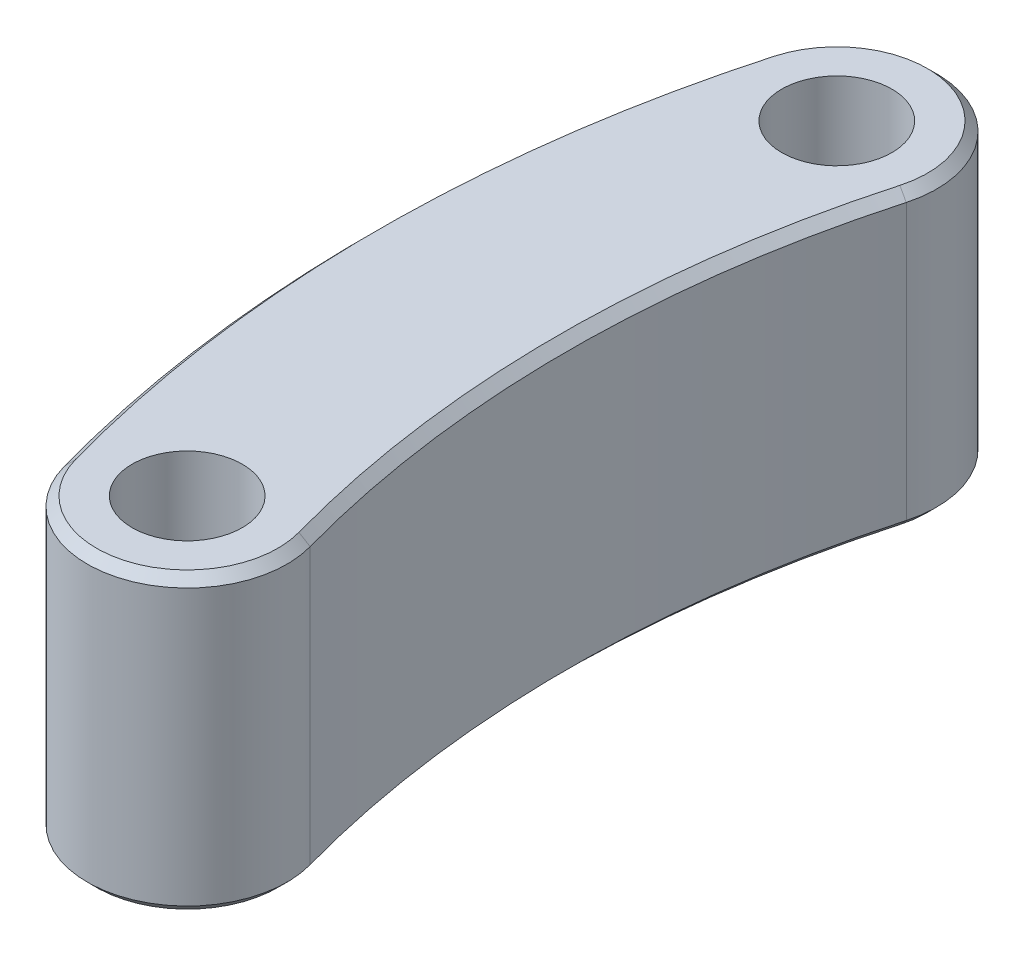
ISO-10303-21;
HEADER;
FILE_DESCRIPTION(('STEP AP214'),'2;1');
FILE_NAME('part.step','',(''),(''),'','','');
FILE_SCHEMA(('AUTOMOTIVE_DESIGN { 1 0 10303 214 1 1 1 1 }'));
ENDSEC;
DATA;
#1=APPLICATION_CONTEXT('core data for automotive mechanical design processes');
#2=APPLICATION_PROTOCOL_DEFINITION('international standard','automotive_design',2000,#1);
#3=PRODUCT_CONTEXT('',#1,'mechanical');
#4=PRODUCT('Part','Part','',(#3));
#5=PRODUCT_RELATED_PRODUCT_CATEGORY('part','',(#4));
#6=PRODUCT_DEFINITION_FORMATION('','',#4);
#7=PRODUCT_DEFINITION_CONTEXT('part definition',#1,'design');
#8=PRODUCT_DEFINITION('design','',#6,#7);
#9=PRODUCT_DEFINITION_SHAPE('','',#8);
#10=(LENGTH_UNIT() NAMED_UNIT(*) SI_UNIT(.MILLI.,.METRE.));
#11=(NAMED_UNIT(*) PLANE_ANGLE_UNIT() SI_UNIT($,.RADIAN.));
#12=(NAMED_UNIT(*) SI_UNIT($,.STERADIAN.) SOLID_ANGLE_UNIT());
#13=UNCERTAINTY_MEASURE_WITH_UNIT(LENGTH_MEASURE(1.E-05),#10,'distance_accuracy_value','');
#14=(GEOMETRIC_REPRESENTATION_CONTEXT(3) GLOBAL_UNCERTAINTY_ASSIGNED_CONTEXT((#13)) GLOBAL_UNIT_ASSIGNED_CONTEXT((#10,
#11,#12)) REPRESENTATION_CONTEXT('',''));
#15=CARTESIAN_POINT('',(0.,0.,0.));
#16=DIRECTION('',(0.,0.,1.));
#17=DIRECTION('',(1.,0.,0.));
#18=AXIS2_PLACEMENT_3D('',#15,#16,#17);
#19=CARTESIAN_POINT('',(31.787355976866,16.,-8.845));
#20=DIRECTION('',(0.,1.,0.));
#21=DIRECTION('',(0.,0.,1.));
#22=AXIS2_PLACEMENT_3D('',#19,#20,#21);
#23=PLANE('',#22);
#24=CARTESIAN_POINT('',(0.,16.,0.));
#25=DIRECTION('',(0.,1.,0.));
#26=DIRECTION('',(0.,0.,1.));
#27=AXIS2_PLACEMENT_3D('',#24,#25,#26);
#28=CIRCLE('',#27,4.93999999999999);
#29=CARTESIAN_POINT('',(-4.75919195410572,16.,1.32427034399151));
#30=VERTEX_POINT('',#29);
#31=CARTESIAN_POINT('',(4.7591919541057,16.,-1.32427034399152));
#32=VERTEX_POINT('',#31);
#33=EDGE_CURVE('E64',#30,#32,#28,.T.);
#34=ORIENTED_EDGE('',*,*,#33,.T.);
#35=CARTESIAN_POINT('',(63.574711953732,16.,-17.69));
#36=DIRECTION('',(0.,1.,0.));
#37=DIRECTION('',(0.,0.,1.));
#38=AXIS2_PLACEMENT_3D('',#35,#36,#37);
#39=CIRCLE('',#38,61.05);
#40=CARTESIAN_POINT('',(4.75919195410571,16.,-34.0557296560085));
#41=VERTEX_POINT('',#40);
#42=EDGE_CURVE('E11',#32,#41,#39,.F.);
#43=ORIENTED_EDGE('',*,*,#42,.T.);
#44=CARTESIAN_POINT('',(0.,16.,-35.38));
#45=DIRECTION('',(0.,1.,0.));
#46=DIRECTION('',(0.,0.,1.));
#47=AXIS2_PLACEMENT_3D('',#44,#45,#46);
#48=CIRCLE('',#47,4.93999999999999);
#49=CARTESIAN_POINT('',(-4.7591919541057,16.,-36.7042703439915));
#50=VERTEX_POINT('',#49);
#51=EDGE_CURVE('E49',#41,#50,#48,.T.);
#52=ORIENTED_EDGE('',*,*,#51,.T.);
#53=CARTESIAN_POINT('',(63.5747119537321,16.,-17.69));
#54=DIRECTION('',(0.,1.,0.));
#55=DIRECTION('',(0.,0.,1.));
#56=AXIS2_PLACEMENT_3D('',#53,#54,#55);
#57=CIRCLE('',#56,70.93);
#58=EDGE_CURVE('E204',#50,#30,#57,.T.);
#59=ORIENTED_EDGE('',*,*,#58,.T.);
#60=EDGE_LOOP('',(#34,#43,#52,#59));
#61=FACE_BOUND('',#60,.T.);
#62=CARTESIAN_POINT('',(0.,16.,0.));
#63=DIRECTION('',(0.,1.,0.));
#64=DIRECTION('',(0.,0.,1.));
#65=AXIS2_PLACEMENT_3D('',#62,#63,#64);
#66=CIRCLE('',#65,3.);
#67=CARTESIAN_POINT('',(0.,16.,3.));
#68=VERTEX_POINT('',#67);
#69=EDGE_CURVE('E177',#68,#68,#66,.T.);
#70=ORIENTED_EDGE('',*,*,#69,.F.);
#71=EDGE_LOOP('',(#70));
#72=FACE_BOUND('',#71,.T.);
#73=CARTESIAN_POINT('',(0.,16.,-35.38));
#74=DIRECTION('',(0.,1.,0.));
#75=DIRECTION('',(0.,0.,1.));
#76=AXIS2_PLACEMENT_3D('',#73,#74,#75);
#77=CIRCLE('',#76,3.);
#78=CARTESIAN_POINT('',(0.,16.,-32.38));
#79=VERTEX_POINT('',#78);
#80=EDGE_CURVE('E169',#79,#79,#77,.T.);
#81=ORIENTED_EDGE('',*,*,#80,.F.);
#82=EDGE_LOOP('',(#81));
#83=FACE_BOUND('',#82,.T.);
#84=ADVANCED_FACE('F39',(#61,#72,#83),#23,.T.);
#85=CARTESIAN_POINT('',(31.787355976866,0.,-8.845));
#86=DIRECTION('',(0.,1.,0.));
#87=DIRECTION('',(0.,0.,1.));
#88=AXIS2_PLACEMENT_3D('',#85,#86,#87);
#89=PLANE('',#88);
#90=CARTESIAN_POINT('',(0.,0.,-35.38));
#91=DIRECTION('',(0.,1.,0.));
#92=DIRECTION('',(0.,0.,1.));
#93=AXIS2_PLACEMENT_3D('',#90,#91,#92);
#94=CIRCLE('',#93,4.94);
#95=CARTESIAN_POINT('',(-4.75919195410572,0.,-36.7042703439915));
#96=VERTEX_POINT('',#95);
#97=CARTESIAN_POINT('',(4.75919195410572,0.,-34.0557296560085));
#98=VERTEX_POINT('',#97);
#99=EDGE_CURVE('E191',#96,#98,#94,.F.);
#100=ORIENTED_EDGE('',*,*,#99,.T.);
#101=CARTESIAN_POINT('',(63.574711953732,0.,-17.69));
#102=DIRECTION('',(0.,1.,0.));
#103=DIRECTION('',(0.,0.,1.));
#104=AXIS2_PLACEMENT_3D('',#101,#102,#103);
#105=CIRCLE('',#104,61.05);
#106=CARTESIAN_POINT('',(4.75919195410571,0.,-1.32427034399152));
#107=VERTEX_POINT('',#106);
#108=EDGE_CURVE('E120',#98,#107,#105,.T.);
#109=ORIENTED_EDGE('',*,*,#108,.T.);
#110=CARTESIAN_POINT('',(0.,0.,0.));
#111=DIRECTION('',(0.,1.,0.));
#112=DIRECTION('',(0.,0.,1.));
#113=AXIS2_PLACEMENT_3D('',#110,#111,#112);
#114=CIRCLE('',#113,4.94);
#115=CARTESIAN_POINT('',(-4.75919195410572,0.,1.32427034399151));
#116=VERTEX_POINT('',#115);
#117=EDGE_CURVE('E189',#107,#116,#114,.F.);
#118=ORIENTED_EDGE('',*,*,#117,.T.);
#119=CARTESIAN_POINT('',(63.5747119537321,0.,-17.69));
#120=DIRECTION('',(0.,1.,0.));
#121=DIRECTION('',(0.,0.,1.));
#122=AXIS2_PLACEMENT_3D('',#119,#120,#121);
#123=CIRCLE('',#122,70.93);
#124=EDGE_CURVE('E187',#116,#96,#123,.F.);
#125=ORIENTED_EDGE('',*,*,#124,.T.);
#126=EDGE_LOOP('',(#100,#109,#118,#125));
#127=FACE_BOUND('',#126,.T.);
#128=CARTESIAN_POINT('',(0.,0.,0.));
#129=DIRECTION('',(0.,1.,0.));
#130=DIRECTION('',(0.,0.,1.));
#131=AXIS2_PLACEMENT_3D('',#128,#129,#130);
#132=CIRCLE('',#131,3.);
#133=CARTESIAN_POINT('',(0.,0.,3.));
#134=VERTEX_POINT('',#133);
#135=EDGE_CURVE('E174',#134,#134,#132,.T.);
#136=ORIENTED_EDGE('',*,*,#135,.T.);
#137=EDGE_LOOP('',(#136));
#138=FACE_BOUND('',#137,.T.);
#139=CARTESIAN_POINT('',(0.,0.,-35.38));
#140=DIRECTION('',(0.,1.,0.));
#141=DIRECTION('',(0.,0.,1.));
#142=AXIS2_PLACEMENT_3D('',#139,#140,#141);
#143=CIRCLE('',#142,3.);
#144=CARTESIAN_POINT('',(0.,0.,-32.38));
#145=VERTEX_POINT('',#144);
#146=EDGE_CURVE('E163',#145,#145,#143,.T.);
#147=ORIENTED_EDGE('',*,*,#146,.T.);
#148=EDGE_LOOP('',(#147));
#149=FACE_BOUND('',#148,.T.);
#150=ADVANCED_FACE('F234',(#127,#138,#149),#89,.F.);
#151=CARTESIAN_POINT('',(63.5747119537321,16.,-17.69));
#152=DIRECTION('',(0.,-1.,0.));
#153=DIRECTION('',(0.,0.,-1.));
#154=AXIS2_PLACEMENT_3D('',#151,#152,#153);
#155=CYLINDRICAL_SURFACE('',#154,71.43);
#156=DIRECTION('',(0.,-1.,0.));
#157=VECTOR('',#156,1.);
#158=CARTESIAN_POINT('',(-5.24089154460225,16.,-36.8383058039097));
#159=LINE('',#158,#157);
#160=CARTESIAN_POINT('',(-5.24089154460225,15.5,-36.8383058039097));
#161=VERTEX_POINT('',#160);
#162=CARTESIAN_POINT('',(-5.24089154460225,0.5,-36.8383058039097));
#163=VERTEX_POINT('',#162);
#164=EDGE_CURVE('E115',#161,#163,#159,.T.);
#165=ORIENTED_EDGE('',*,*,#164,.T.);
#166=CARTESIAN_POINT('',(63.5747119537321,0.5,-17.69));
#167=DIRECTION('',(0.,1.,0.));
#168=DIRECTION('',(0.,0.,1.));
#169=AXIS2_PLACEMENT_3D('',#166,#167,#168);
#170=CIRCLE('',#169,71.43);
#171=CARTESIAN_POINT('',(-5.24089154460225,0.5,1.45830580390968));
#172=VERTEX_POINT('',#171);
#173=EDGE_CURVE('E202',#163,#172,#170,.T.);
#174=ORIENTED_EDGE('',*,*,#173,.T.);
#175=DIRECTION('',(0.,-1.,0.));
#176=VECTOR('',#175,1.);
#177=CARTESIAN_POINT('',(-5.24089154460225,16.,1.45830580390968));
#178=LINE('',#177,#176);
#179=CARTESIAN_POINT('',(-5.24089154460225,15.5,1.45830580390968));
#180=VERTEX_POINT('',#179);
#181=EDGE_CURVE('E136',#180,#172,#178,.T.);
#182=ORIENTED_EDGE('',*,*,#181,.F.);
#183=CARTESIAN_POINT('',(63.5747119537321,15.5,-17.69));
#184=DIRECTION('',(0.,1.,0.));
#185=DIRECTION('',(0.,0.,1.));
#186=AXIS2_PLACEMENT_3D('',#183,#184,#185);
#187=CIRCLE('',#186,71.43);
#188=EDGE_CURVE('E200',#180,#161,#187,.F.);
#189=ORIENTED_EDGE('',*,*,#188,.T.);
#190=EDGE_LOOP('',(#165,#174,#182,#189));
#191=FACE_BOUND('',#190,.T.);
#192=ADVANCED_FACE('F215',(#191),#155,.T.);
#193=CARTESIAN_POINT('',(0.,16.,0.));
#194=DIRECTION('',(0.,-1.,0.));
#195=DIRECTION('',(0.,0.,-1.));
#196=AXIS2_PLACEMENT_3D('',#193,#194,#195);
#197=CYLINDRICAL_SURFACE('',#196,5.44);
#198=ORIENTED_EDGE('',*,*,#181,.T.);
#199=CARTESIAN_POINT('',(0.,0.5,0.));
#200=DIRECTION('',(0.,1.,0.));
#201=DIRECTION('',(0.,0.,1.));
#202=AXIS2_PLACEMENT_3D('',#199,#200,#201);
#203=CIRCLE('',#202,5.44);
#204=CARTESIAN_POINT('',(5.24089154460225,0.5,-1.45830580390969));
#205=VERTEX_POINT('',#204);
#206=EDGE_CURVE('E198',#172,#205,#203,.T.);
#207=ORIENTED_EDGE('',*,*,#206,.T.);
#208=DIRECTION('',(0.,-1.,0.));
#209=VECTOR('',#208,1.);
#210=CARTESIAN_POINT('',(5.24089154460225,16.,-1.45830580390969));
#211=LINE('',#210,#209);
#212=CARTESIAN_POINT('',(5.24089154460225,15.5,-1.45830580390969));
#213=VERTEX_POINT('',#212);
#214=EDGE_CURVE('E131',#213,#205,#211,.T.);
#215=ORIENTED_EDGE('',*,*,#214,.F.);
#216=CARTESIAN_POINT('',(0.,15.5,0.));
#217=DIRECTION('',(0.,1.,0.));
#218=DIRECTION('',(0.,0.,1.));
#219=AXIS2_PLACEMENT_3D('',#216,#217,#218);
#220=CIRCLE('',#219,5.44);
#221=EDGE_CURVE('E196',#213,#180,#220,.F.);
#222=ORIENTED_EDGE('',*,*,#221,.T.);
#223=EDGE_LOOP('',(#198,#207,#215,#222));
#224=FACE_BOUND('',#223,.T.);
#225=ADVANCED_FACE('F213',(#224),#197,.T.);
#226=CARTESIAN_POINT('',(63.574711953732,16.,-17.69));
#227=DIRECTION('',(0.,-1.,0.));
#228=DIRECTION('',(0.,0.,-1.));
#229=AXIS2_PLACEMENT_3D('',#226,#227,#228);
#230=CYLINDRICAL_SURFACE('',#229,60.55);
#231=ORIENTED_EDGE('',*,*,#214,.T.);
#232=CARTESIAN_POINT('',(63.574711953732,0.5,-17.69));
#233=DIRECTION('',(0.,1.,0.));
#234=DIRECTION('',(0.,0.,1.));
#235=AXIS2_PLACEMENT_3D('',#232,#233,#234);
#236=CIRCLE('',#235,60.55);
#237=CARTESIAN_POINT('',(5.24089154460225,0.5,-33.9216941960903));
#238=VERTEX_POINT('',#237);
#239=EDGE_CURVE('E130',#205,#238,#236,.F.);
#240=ORIENTED_EDGE('',*,*,#239,.T.);
#241=DIRECTION('',(0.,-1.,0.));
#242=VECTOR('',#241,1.);
#243=CARTESIAN_POINT('',(5.24089154460225,16.,-33.9216941960903));
#244=LINE('',#243,#242);
#245=CARTESIAN_POINT('',(5.24089154460225,15.5,-33.9216941960903));
#246=VERTEX_POINT('',#245);
#247=EDGE_CURVE('E113',#246,#238,#244,.T.);
#248=ORIENTED_EDGE('',*,*,#247,.F.);
#249=CARTESIAN_POINT('',(63.574711953732,15.5,-17.69));
#250=DIRECTION('',(0.,1.,0.));
#251=DIRECTION('',(0.,0.,1.));
#252=AXIS2_PLACEMENT_3D('',#249,#250,#251);
#253=CIRCLE('',#252,60.55);
#254=EDGE_CURVE('E127',#246,#213,#253,.T.);
#255=ORIENTED_EDGE('',*,*,#254,.T.);
#256=EDGE_LOOP('',(#231,#240,#248,#255));
#257=FACE_BOUND('',#256,.T.);
#258=ADVANCED_FACE('F126',(#257),#230,.F.);
#259=CARTESIAN_POINT('',(0.,16.,-35.38));
#260=DIRECTION('',(0.,-1.,0.));
#261=DIRECTION('',(0.,0.,-1.));
#262=AXIS2_PLACEMENT_3D('',#259,#260,#261);
#263=CYLINDRICAL_SURFACE('',#262,5.44);
#264=ORIENTED_EDGE('',*,*,#247,.T.);
#265=CARTESIAN_POINT('',(0.,0.5,-35.38));
#266=DIRECTION('',(0.,1.,0.));
#267=DIRECTION('',(0.,0.,1.));
#268=AXIS2_PLACEMENT_3D('',#265,#266,#267);
#269=CIRCLE('',#268,5.44);
#270=EDGE_CURVE('E119',#238,#163,#269,.T.);
#271=ORIENTED_EDGE('',*,*,#270,.T.);
#272=ORIENTED_EDGE('',*,*,#164,.F.);
#273=CARTESIAN_POINT('',(0.,15.5,-35.38));
#274=DIRECTION('',(0.,1.,0.));
#275=DIRECTION('',(0.,0.,1.));
#276=AXIS2_PLACEMENT_3D('',#273,#274,#275);
#277=CIRCLE('',#276,5.44);
#278=EDGE_CURVE('E110',#161,#246,#277,.F.);
#279=ORIENTED_EDGE('',*,*,#278,.T.);
#280=EDGE_LOOP('',(#264,#271,#272,#279));
#281=FACE_BOUND('',#280,.T.);
#282=ADVANCED_FACE('F112',(#281),#263,.T.);
#283=CARTESIAN_POINT('',(0.,16.,0.));
#284=DIRECTION('',(0.,-1.,0.));
#285=DIRECTION('',(0.,0.,-1.));
#286=AXIS2_PLACEMENT_3D('',#283,#284,#285);
#287=CYLINDRICAL_SURFACE('',#286,3.);
#288=ORIENTED_EDGE('',*,*,#69,.T.);
#289=EDGE_LOOP('',(#288));
#290=FACE_BOUND('',#289,.T.);
#291=ORIENTED_EDGE('',*,*,#135,.F.);
#292=EDGE_LOOP('',(#291));
#293=FACE_BOUND('',#292,.T.);
#294=ADVANCED_FACE('F242',(#290,#293),#287,.F.);
#295=CARTESIAN_POINT('',(0.,16.,-35.38));
#296=DIRECTION('',(0.,-1.,0.));
#297=DIRECTION('',(0.,0.,-1.));
#298=AXIS2_PLACEMENT_3D('',#295,#296,#297);
#299=CYLINDRICAL_SURFACE('',#298,3.);
#300=ORIENTED_EDGE('',*,*,#80,.T.);
#301=EDGE_LOOP('',(#300));
#302=FACE_BOUND('',#301,.T.);
#303=ORIENTED_EDGE('',*,*,#146,.F.);
#304=EDGE_LOOP('',(#303));
#305=FACE_BOUND('',#304,.T.);
#306=ADVANCED_FACE('F274',(#302,#305),#299,.F.);
#307=CARTESIAN_POINT('',(63.5747119537321,0.5,-17.69));
#308=DIRECTION('',(0.,1.,0.));
#309=DIRECTION('',(0.,0.,1.));
#310=AXIS2_PLACEMENT_3D('',#307,#308,#309);
#311=CONICAL_SURFACE('',#310,71.43,0.785398163397448);
#312=DIRECTION('',(-0.681226093869758,0.707106781186548,-0.189554765255192));
#313=VECTOR('',#312,1.);
#314=CARTESIAN_POINT('',(-4.75919195410572,0.,-36.7042703439915));
#315=LINE('',#314,#313);
#316=EDGE_CURVE('E155',#96,#163,#315,.T.);
#317=ORIENTED_EDGE('',*,*,#316,.F.);
#318=ORIENTED_EDGE('',*,*,#124,.F.);
#319=DIRECTION('',(0.681226093869759,-0.707106781186548,-0.189554765255191));
#320=VECTOR('',#319,1.);
#321=CARTESIAN_POINT('',(-5.24089154460225,0.5,1.45830580390968));
#322=LINE('',#321,#320);
#323=EDGE_CURVE('E143',#172,#116,#322,.T.);
#324=ORIENTED_EDGE('',*,*,#323,.F.);
#325=ORIENTED_EDGE('',*,*,#173,.F.);
#326=EDGE_LOOP('',(#317,#318,#324,#325));
#327=FACE_BOUND('',#326,.T.);
#328=ADVANCED_FACE('F218',(#327),#311,.T.);
#329=CARTESIAN_POINT('',(0.,0.5,0.));
#330=DIRECTION('',(0.,1.,0.));
#331=DIRECTION('',(0.,0.,1.));
#332=AXIS2_PLACEMENT_3D('',#329,#330,#331);
#333=CONICAL_SURFACE('',#332,5.44,0.785398163397448);
#334=ORIENTED_EDGE('',*,*,#323,.T.);
#335=ORIENTED_EDGE('',*,*,#117,.F.);
#336=DIRECTION('',(-0.68122609386976,-0.707106781186547,0.18955476525519));
#337=VECTOR('',#336,1.);
#338=CARTESIAN_POINT('',(5.24089154460225,0.5,-1.45830580390969));
#339=LINE('',#338,#337);
#340=EDGE_CURVE('E149',#205,#107,#339,.T.);
#341=ORIENTED_EDGE('',*,*,#340,.F.);
#342=ORIENTED_EDGE('',*,*,#206,.F.);
#343=EDGE_LOOP('',(#334,#335,#341,#342));
#344=FACE_BOUND('',#343,.T.);
#345=ADVANCED_FACE('F221',(#344),#333,.T.);
#346=CARTESIAN_POINT('',(0.,0.5,-35.38));
#347=DIRECTION('',(0.,1.,0.));
#348=DIRECTION('',(0.,0.,1.));
#349=AXIS2_PLACEMENT_3D('',#346,#347,#348);
#350=CONICAL_SURFACE('',#349,5.44,0.785398163397448);
#351=ORIENTED_EDGE('',*,*,#316,.T.);
#352=ORIENTED_EDGE('',*,*,#270,.F.);
#353=DIRECTION('',(0.681226093869757,0.707106781186549,0.189554765255192));
#354=VECTOR('',#353,1.);
#355=CARTESIAN_POINT('',(4.75919195410572,0.,-34.0557296560085));
#356=LINE('',#355,#354);
#357=EDGE_CURVE('E146',#98,#238,#356,.T.);
#358=ORIENTED_EDGE('',*,*,#357,.F.);
#359=ORIENTED_EDGE('',*,*,#99,.F.);
#360=EDGE_LOOP('',(#351,#352,#358,#359));
#361=FACE_BOUND('',#360,.T.);
#362=ADVANCED_FACE('F224',(#361),#350,.T.);
#363=CARTESIAN_POINT('',(63.574711953732,0.5,-17.69));
#364=DIRECTION('',(0.,-1.,0.));
#365=DIRECTION('',(0.,0.,-1.));
#366=AXIS2_PLACEMENT_3D('',#363,#364,#365);
#367=CONICAL_SURFACE('',#366,60.55,0.785398163397448);
#368=ORIENTED_EDGE('',*,*,#340,.T.);
#369=ORIENTED_EDGE('',*,*,#108,.F.);
#370=ORIENTED_EDGE('',*,*,#357,.T.);
#371=ORIENTED_EDGE('',*,*,#239,.F.);
#372=EDGE_LOOP('',(#368,#369,#370,#371));
#373=FACE_BOUND('',#372,.T.);
#374=ADVANCED_FACE('F222',(#373),#367,.F.);
#375=CARTESIAN_POINT('',(63.5747119537321,16.,-17.69));
#376=DIRECTION('',(0.,-1.,0.));
#377=DIRECTION('',(0.,0.,-1.));
#378=AXIS2_PLACEMENT_3D('',#375,#376,#377);
#379=CONICAL_SURFACE('',#378,70.93,0.785398163397448);
#380=DIRECTION('',(0.68122609386976,0.707106781186548,0.189554765255187));
#381=VECTOR('',#380,1.);
#382=CARTESIAN_POINT('',(-5.24089154460225,15.5,-36.8383058039097));
#383=LINE('',#382,#381);
#384=EDGE_CURVE('E140',#161,#50,#383,.T.);
#385=ORIENTED_EDGE('',*,*,#384,.F.);
#386=ORIENTED_EDGE('',*,*,#188,.F.);
#387=DIRECTION('',(-0.681226093869749,-0.707106781186557,0.189554765255188));
#388=VECTOR('',#387,1.);
#389=CARTESIAN_POINT('',(-4.75919195410572,16.,1.32427034399151));
#390=LINE('',#389,#388);
#391=EDGE_CURVE('E44',#30,#180,#390,.T.);
#392=ORIENTED_EDGE('',*,*,#391,.F.);
#393=ORIENTED_EDGE('',*,*,#58,.F.);
#394=EDGE_LOOP('',(#385,#386,#392,#393));
#395=FACE_BOUND('',#394,.T.);
#396=ADVANCED_FACE('F42',(#395),#379,.T.);
#397=CARTESIAN_POINT('',(0.,16.,0.));
#398=DIRECTION('',(0.,-1.,0.));
#399=DIRECTION('',(0.,0.,-1.));
#400=AXIS2_PLACEMENT_3D('',#397,#398,#399);
#401=CONICAL_SURFACE('',#400,4.93999999999999,0.785398163397448);
#402=ORIENTED_EDGE('',*,*,#391,.T.);
#403=ORIENTED_EDGE('',*,*,#221,.F.);
#404=DIRECTION('',(0.681226093869759,-0.707106781186547,-0.18955476525519));
#405=VECTOR('',#404,1.);
#406=CARTESIAN_POINT('',(4.7591919541057,16.,-1.32427034399152));
#407=LINE('',#406,#405);
#408=EDGE_CURVE('E134',#32,#213,#407,.T.);
#409=ORIENTED_EDGE('',*,*,#408,.F.);
#410=ORIENTED_EDGE('',*,*,#33,.F.);
#411=EDGE_LOOP('',(#402,#403,#409,#410));
#412=FACE_BOUND('',#411,.T.);
#413=ADVANCED_FACE('F210',(#412),#401,.T.);
#414=CARTESIAN_POINT('',(0.,16.,-35.38));
#415=DIRECTION('',(0.,-1.,0.));
#416=DIRECTION('',(0.,0.,-1.));
#417=AXIS2_PLACEMENT_3D('',#414,#415,#416);
#418=CONICAL_SURFACE('',#417,4.93999999999999,0.785398163397448);
#419=ORIENTED_EDGE('',*,*,#384,.T.);
#420=ORIENTED_EDGE('',*,*,#51,.F.);
#421=DIRECTION('',(-0.681226093869759,0.707106781186548,-0.189554765255187));
#422=VECTOR('',#421,1.);
#423=CARTESIAN_POINT('',(5.24089154460225,15.5,-33.9216941960903));
#424=LINE('',#423,#422);
#425=EDGE_CURVE('E57',#246,#41,#424,.T.);
#426=ORIENTED_EDGE('',*,*,#425,.F.);
#427=ORIENTED_EDGE('',*,*,#278,.F.);
#428=EDGE_LOOP('',(#419,#420,#426,#427));
#429=FACE_BOUND('',#428,.T.);
#430=ADVANCED_FACE('F138',(#429),#418,.T.);
#431=CARTESIAN_POINT('',(63.574711953732,16.,-17.69));
#432=DIRECTION('',(0.,1.,0.));
#433=DIRECTION('',(0.,0.,1.));
#434=AXIS2_PLACEMENT_3D('',#431,#432,#433);
#435=CONICAL_SURFACE('',#434,61.05,0.785398163397448);
#436=ORIENTED_EDGE('',*,*,#408,.T.);
#437=ORIENTED_EDGE('',*,*,#254,.F.);
#438=ORIENTED_EDGE('',*,*,#425,.T.);
#439=ORIENTED_EDGE('',*,*,#42,.F.);
#440=EDGE_LOOP('',(#436,#437,#438,#439));
#441=FACE_BOUND('',#440,.T.);
#442=ADVANCED_FACE('F133',(#441),#435,.F.);
#443=CLOSED_SHELL('',(#84,#150,#192,#225,#258,#282,#294,#306,#328,#345,#362,#374,#396,#413,#430,#442));
#444=MANIFOLD_SOLID_BREP('B2',#443);
#445=ADVANCED_BREP_SHAPE_REPRESENTATION('',(#18,#444),#14);
#446=SHAPE_DEFINITION_REPRESENTATION(#9,#445);
ENDSEC;
END-ISO-10303-21;
